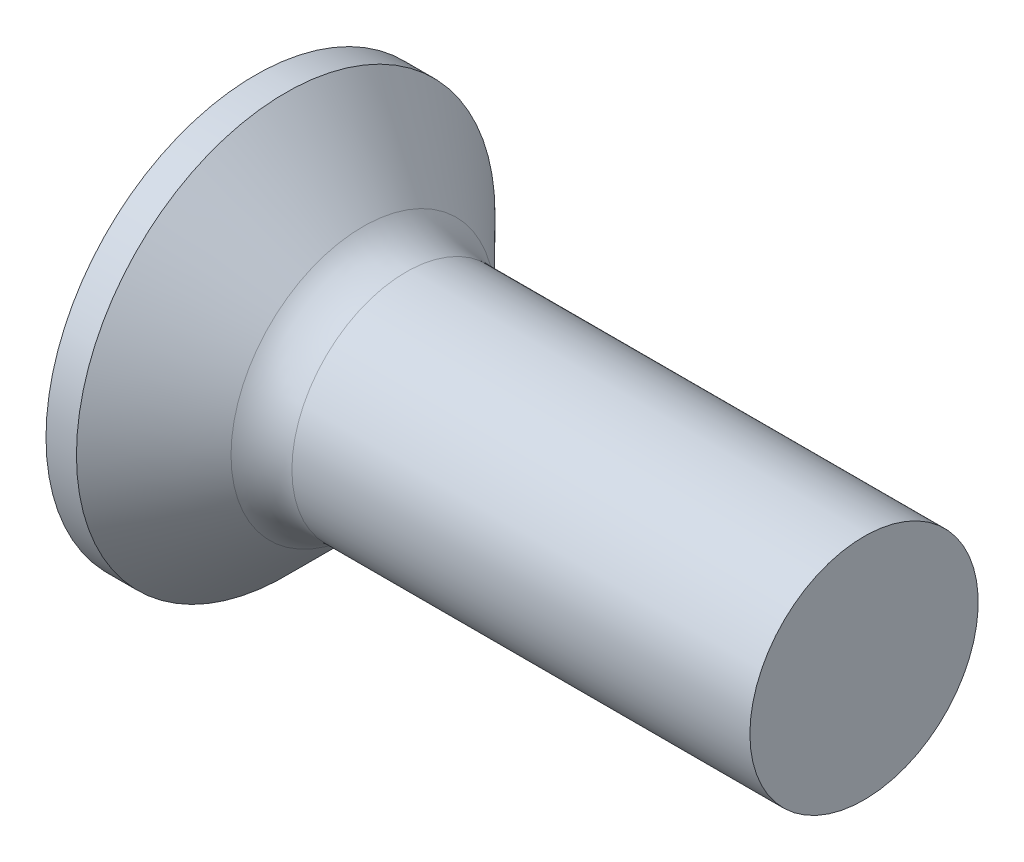
ISO-10303-21;
HEADER;
FILE_DESCRIPTION(('STEP AP214'),'2;1');
FILE_NAME('part.step','',(''),(''),'','','');
FILE_SCHEMA(('AUTOMOTIVE_DESIGN { 1 0 10303 214 1 1 1 1 }'));
ENDSEC;
DATA;
#1=APPLICATION_CONTEXT('core data for automotive mechanical design processes');
#2=APPLICATION_PROTOCOL_DEFINITION('international standard','automotive_design',2000,#1);
#3=PRODUCT_CONTEXT('',#1,'mechanical');
#4=PRODUCT('Part','Part','',(#3));
#5=PRODUCT_RELATED_PRODUCT_CATEGORY('part','',(#4));
#6=PRODUCT_DEFINITION_FORMATION('','',#4);
#7=PRODUCT_DEFINITION_CONTEXT('part definition',#1,'design');
#8=PRODUCT_DEFINITION('design','',#6,#7);
#9=PRODUCT_DEFINITION_SHAPE('','',#8);
#10=(LENGTH_UNIT() NAMED_UNIT(*) SI_UNIT(.MILLI.,.METRE.));
#11=(NAMED_UNIT(*) PLANE_ANGLE_UNIT() SI_UNIT($,.RADIAN.));
#12=(NAMED_UNIT(*) SI_UNIT($,.STERADIAN.) SOLID_ANGLE_UNIT());
#13=UNCERTAINTY_MEASURE_WITH_UNIT(LENGTH_MEASURE(1.E-05),#10,'distance_accuracy_value','');
#14=(GEOMETRIC_REPRESENTATION_CONTEXT(3) GLOBAL_UNCERTAINTY_ASSIGNED_CONTEXT((#13)) GLOBAL_UNIT_ASSIGNED_CONTEXT((#10,
#11,#12)) REPRESENTATION_CONTEXT('',''));
#15=CARTESIAN_POINT('',(0.,0.,0.));
#16=DIRECTION('',(0.,0.,1.));
#17=DIRECTION('',(1.,0.,0.));
#18=AXIS2_PLACEMENT_3D('',#15,#16,#17);
#19=CARTESIAN_POINT('',(2.01,-0.497851135403458,0.37));
#20=DIRECTION('',(0.,0.,-1.));
#21=DIRECTION('',(0.,1.,0.));
#22=AXIS2_PLACEMENT_3D('',#19,#20,#21);
#23=PLANE('',#22);
#24=DIRECTION('',(0.,-1.,0.));
#25=VECTOR('',#24,1.);
#26=CARTESIAN_POINT('',(0.,1.5,0.37));
#27=LINE('',#26,#25);
#28=CARTESIAN_POINT('',(0.,-0.590157547916263,0.37));
#29=VERTEX_POINT('',#28);
#30=CARTESIAN_POINT('',(0.,-1.5,0.37));
#31=VERTEX_POINT('',#30);
#32=EDGE_CURVE('E458',#29,#31,#27,.T.);
#33=ORIENTED_EDGE('',*,*,#32,.F.);
#34=CARTESIAN_POINT('',(-1.01053649691082,-0.672102030072118,0.37));
#35=CARTESIAN_POINT('',(-0.79970605871103,-0.655267098883947,0.37));
#36=CARTESIAN_POINT('',(-0.588886212503304,-0.638297110572311,0.37));
#37=CARTESIAN_POINT('',(-0.167272662529611,-0.603984130519828,0.37));
#38=CARTESIAN_POINT('',(0.0435210406290472,-0.586641131324258,0.37));
#39=CARTESIAN_POINT('',(0.465068838244709,-0.551479911667385,0.37));
#40=CARTESIAN_POINT('',(0.67582293271526,-0.533661691368909,0.37));
#41=CARTESIAN_POINT('',(1.09727362083221,-0.497387538872971,0.37));
#42=CARTESIAN_POINT('',(1.30797021521736,-0.478931615299089,0.37));
#43=CARTESIAN_POINT('',(1.67418894757201,-0.446067164121906,0.37));
#44=CARTESIAN_POINT('',(1.82972932585734,-0.431862501028414,0.37));
#45=CARTESIAN_POINT('',(2.14074770359484,-0.40279770973988,0.37));
#46=CARTESIAN_POINT('',(2.29622570356215,-0.38793758707517,0.37));
#47=CARTESIAN_POINT('',(2.60710169348415,-0.357305117937677,0.37));
#48=CARTESIAN_POINT('',(2.76249967840253,-0.34153271979064,0.37));
#49=CARTESIAN_POINT('',(2.99549070742189,-0.316847908281595,0.37));
#50=CARTESIAN_POINT('',(3.07313791118864,-0.308448465897182,0.37));
#51=CARTESIAN_POINT('',(3.22838341575769,-0.29120225104834,0.37));
#52=CARTESIAN_POINT('',(3.30598171599396,-0.282355473499083,0.37));
#53=CARTESIAN_POINT('',(3.38354828463398,-0.273232461289951,0.37));
#54=B_SPLINE_CURVE_WITH_KNOTS('',3,(#34,#35,#36,#37,#38,#39,#40,#41,#42,#43,#44,#45,#46,#47,#48,
#49,#50,#51,#52,#53),.UNSPECIFIED.,.F.,.F.,(4,2,2,2,2,2,2,2,2,4),(0.,0.634504777554397,
1.26902224766093,1.90353950036111,2.53804817592041,3.00661008438666,3.47516804019383,
3.94375256268972,4.17805198331268,4.41235406779909),.UNSPECIFIED.);
#55=CARTESIAN_POINT('',(2.01,-0.415013252800437,0.37));
#56=VERTEX_POINT('',#55);
#57=EDGE_CURVE('E213',#29,#56,#54,.T.);
#58=ORIENTED_EDGE('',*,*,#57,.T.);
#59=DIRECTION('',(0.,-1.,0.));
#60=VECTOR('',#59,1.);
#61=CARTESIAN_POINT('',(2.01,0.497851135403459,0.37));
#62=LINE('',#61,#60);
#63=CARTESIAN_POINT('',(2.01,-0.497851135403458,0.37));
#64=VERTEX_POINT('',#63);
#65=EDGE_CURVE('E366',#56,#64,#62,.T.);
#66=ORIENTED_EDGE('',*,*,#65,.T.);
#67=DIRECTION('',(0.894934391398442,0.446197753347436,0.));
#68=VECTOR('',#67,1.);
#69=CARTESIAN_POINT('',(0.,-1.5,0.37));
#70=LINE('',#69,#68);
#71=EDGE_CURVE('E466',#31,#64,#70,.T.);
#72=ORIENTED_EDGE('',*,*,#71,.F.);
#73=EDGE_LOOP('',(#33,#58,#66,#72));
#74=FACE_BOUND('',#73,.T.);
#75=ADVANCED_FACE('F34',(#74),#23,.T.);
#76=CARTESIAN_POINT('',(2.01,0.497851135403459,0.37));
#77=VERTEX_POINT('',#76);
#78=CARTESIAN_POINT('',(2.01,0.415013252800437,0.37));
#79=VERTEX_POINT('',#78);
#80=EDGE_CURVE('E362',#77,#79,#62,.T.);
#81=ORIENTED_EDGE('',*,*,#80,.T.);
#82=CARTESIAN_POINT('',(-1.01053649699026,0.672102030078459,0.37));
#83=CARTESIAN_POINT('',(-0.799706058781648,0.65526709888962,0.37));
#84=CARTESIAN_POINT('',(-0.588886212565099,0.638297110577309,0.37));
#85=CARTESIAN_POINT('',(-0.167272662573758,0.603984130523453,0.37));
#86=CARTESIAN_POINT('',(0.043521040593722,0.586641131327185,0.37));
#87=CARTESIAN_POINT('',(0.465068838236453,0.551479911668094,0.37));
#88=CARTESIAN_POINT('',(0.675822932725248,0.533661691368078,0.37));
#89=CARTESIAN_POINT('',(1.09727362087867,0.497387538868943,0.37));
#90=CARTESIAN_POINT('',(1.30797021528206,0.478931615293404,0.37));
#91=CARTESIAN_POINT('',(1.67418894765493,0.446067164114376,0.37));
#92=CARTESIAN_POINT('',(1.82972932594025,0.431862501020785,0.37));
#93=CARTESIAN_POINT('',(2.14074770367772,0.402797709732016,0.37));
#94=CARTESIAN_POINT('',(2.29622570364503,0.38793758706717,0.37));
#95=CARTESIAN_POINT('',(2.60710169356699,0.357305117929346,0.37));
#96=CARTESIAN_POINT('',(2.76249967848536,0.341532719782116,0.37));
#97=CARTESIAN_POINT('',(2.99549070750468,0.316847908272698,0.37));
#98=CARTESIAN_POINT('',(3.07313791127142,0.308448465888148,0.37));
#99=CARTESIAN_POINT('',(3.22838341584044,0.291202251038989,0.37));
#100=CARTESIAN_POINT('',(3.30598171607669,0.282355473489554,0.37));
#101=CARTESIAN_POINT('',(3.38354828471668,0.273232461280216,0.37));
#102=B_SPLINE_CURVE_WITH_KNOTS('',3,(#82,#83,#84,#85,#86,#87,#88,#89,#90,#91,#92,#93,#94,#95,
#96,#97,#98,#99,#100,#101),.UNSPECIFIED.,.F.,.F.,(4,2,2,2,2,2,2,2,2,4),(0.,0.634504777580945,
1.26902224771403,1.90353950046914,2.53804817608336,3.00661008454961,3.47516804035678,
3.94375256285268,4.17805198347564,4.41235406796206),.UNSPECIFIED.);
#103=CARTESIAN_POINT('',(0.,0.590157547916263,0.37));
#104=VERTEX_POINT('',#103);
#105=EDGE_CURVE('E206',#79,#104,#102,.F.);
#106=ORIENTED_EDGE('',*,*,#105,.T.);
#107=CARTESIAN_POINT('',(0.,1.5,0.37));
#108=VERTEX_POINT('',#107);
#109=EDGE_CURVE('E460',#108,#104,#27,.T.);
#110=ORIENTED_EDGE('',*,*,#109,.F.);
#111=DIRECTION('',(0.894934391398442,-0.446197753347436,0.));
#112=VECTOR('',#111,1.);
#113=CARTESIAN_POINT('',(0.,1.5,0.37));
#114=LINE('',#113,#112);
#115=EDGE_CURVE('E57',#108,#77,#114,.T.);
#116=ORIENTED_EDGE('',*,*,#115,.T.);
#117=EDGE_LOOP('',(#81,#106,#110,#116));
#118=FACE_BOUND('',#117,.T.);
#119=ADVANCED_FACE('F188',(#118),#23,.T.);
#120=CARTESIAN_POINT('',(2.01,0.497851135403458,-0.37));
#121=DIRECTION('',(0.,0.,1.));
#122=DIRECTION('',(1.,0.,0.));
#123=AXIS2_PLACEMENT_3D('',#120,#121,#122);
#124=PLANE('',#123);
#125=DIRECTION('',(0.,1.,0.));
#126=VECTOR('',#125,1.);
#127=CARTESIAN_POINT('',(2.01,-0.497851135403458,-0.37));
#128=LINE('',#127,#126);
#129=CARTESIAN_POINT('',(2.01,-0.497851135403458,-0.37));
#130=VERTEX_POINT('',#129);
#131=CARTESIAN_POINT('',(2.01,-0.415013252800437,-0.37));
#132=VERTEX_POINT('',#131);
#133=EDGE_CURVE('E375',#130,#132,#128,.T.);
#134=ORIENTED_EDGE('',*,*,#133,.T.);
#135=CARTESIAN_POINT('',(-1.01053649691082,-0.672102030072118,-0.37));
#136=CARTESIAN_POINT('',(-0.79970605871103,-0.655267098883947,-0.37));
#137=CARTESIAN_POINT('',(-0.588886212503305,-0.638297110572311,-0.37));
#138=CARTESIAN_POINT('',(-0.16727266252961,-0.603984130519828,-0.37));
#139=CARTESIAN_POINT('',(0.0435210406290472,-0.586641131324259,-0.37));
#140=CARTESIAN_POINT('',(0.465068838244709,-0.551479911667385,-0.37));
#141=CARTESIAN_POINT('',(0.67582293271526,-0.533661691368909,-0.37));
#142=CARTESIAN_POINT('',(1.09727362083221,-0.497387538872971,-0.37));
#143=CARTESIAN_POINT('',(1.30797021521736,-0.47893161529909,-0.37));
#144=CARTESIAN_POINT('',(1.67418894757201,-0.446067164121906,-0.37));
#145=CARTESIAN_POINT('',(1.82972932585734,-0.431862501028414,-0.37));
#146=CARTESIAN_POINT('',(2.14074770359484,-0.40279770973988,-0.37));
#147=CARTESIAN_POINT('',(2.29622570356215,-0.38793758707517,-0.37));
#148=CARTESIAN_POINT('',(2.60710169348415,-0.357305117937677,-0.37));
#149=CARTESIAN_POINT('',(2.76249967840254,-0.34153271979064,-0.37));
#150=CARTESIAN_POINT('',(2.99549070742189,-0.316847908281595,-0.37));
#151=CARTESIAN_POINT('',(3.07313791118864,-0.308448465897182,-0.37));
#152=CARTESIAN_POINT('',(3.22838341575769,-0.29120225104834,-0.37));
#153=CARTESIAN_POINT('',(3.30598171599396,-0.282355473499083,-0.37));
#154=CARTESIAN_POINT('',(3.38354828463398,-0.273232461289951,-0.37));
#155=B_SPLINE_CURVE_WITH_KNOTS('',3,(#135,#136,#137,#138,#139,#140,#141,#142,#143,#144,#145,
#146,#147,#148,#149,#150,#151,#152,#153,#154),.UNSPECIFIED.,.F.,.F.,(4,2,2,2,2,2,2,2,2,4),(0.,
0.634504777554397,1.26902224766093,1.90353950036111,2.53804817592041,3.00661008438666,
3.47516804019383,3.94375256268973,4.17805198331268,4.41235406779909),.UNSPECIFIED.);
#156=CARTESIAN_POINT('',(0.,-0.590157547916263,-0.37));
#157=VERTEX_POINT('',#156);
#158=EDGE_CURVE('E269',#132,#157,#155,.F.);
#159=ORIENTED_EDGE('',*,*,#158,.T.);
#160=DIRECTION('',(0.,1.,0.));
#161=VECTOR('',#160,1.);
#162=CARTESIAN_POINT('',(0.,-1.5,-0.37));
#163=LINE('',#162,#161);
#164=CARTESIAN_POINT('',(0.,-1.5,-0.37));
#165=VERTEX_POINT('',#164);
#166=EDGE_CURVE('E459',#165,#157,#163,.T.);
#167=ORIENTED_EDGE('',*,*,#166,.F.);
#168=DIRECTION('',(0.894934391398442,0.446197753347436,0.));
#169=VECTOR('',#168,1.);
#170=CARTESIAN_POINT('',(0.,-1.5,-0.37));
#171=LINE('',#170,#169);
#172=EDGE_CURVE('E469',#165,#130,#171,.T.);
#173=ORIENTED_EDGE('',*,*,#172,.T.);
#174=EDGE_LOOP('',(#134,#159,#167,#173));
#175=FACE_BOUND('',#174,.T.);
#176=ADVANCED_FACE('F194',(#175),#124,.T.);
#177=CARTESIAN_POINT('',(0.,0.590157547916263,-0.37));
#178=VERTEX_POINT('',#177);
#179=CARTESIAN_POINT('',(0.,1.5,-0.37));
#180=VERTEX_POINT('',#179);
#181=EDGE_CURVE('E465',#178,#180,#163,.T.);
#182=ORIENTED_EDGE('',*,*,#181,.F.);
#183=CARTESIAN_POINT('',(-1.01053649691082,0.672102030072118,-0.37));
#184=CARTESIAN_POINT('',(-0.79970605871103,0.655267098883947,-0.37));
#185=CARTESIAN_POINT('',(-0.588886212503304,0.638297110572311,-0.37));
#186=CARTESIAN_POINT('',(-0.16727266252961,0.603984130519828,-0.37));
#187=CARTESIAN_POINT('',(0.0435210406290473,0.586641131324259,-0.37));
#188=CARTESIAN_POINT('',(0.465068838244709,0.551479911667385,-0.37));
#189=CARTESIAN_POINT('',(0.67582293271526,0.533661691368909,-0.37));
#190=CARTESIAN_POINT('',(1.09727362083221,0.497387538872971,-0.37));
#191=CARTESIAN_POINT('',(1.30797021521736,0.478931615299089,-0.37));
#192=CARTESIAN_POINT('',(1.67418894757201,0.446067164121906,-0.37));
#193=CARTESIAN_POINT('',(1.82972932585734,0.431862501028415,-0.37));
#194=CARTESIAN_POINT('',(2.14074770359484,0.40279770973988,-0.37));
#195=CARTESIAN_POINT('',(2.29622570356215,0.38793758707517,-0.37));
#196=CARTESIAN_POINT('',(2.60710169348415,0.357305117937677,-0.37));
#197=CARTESIAN_POINT('',(2.76249967840253,0.34153271979064,-0.37));
#198=CARTESIAN_POINT('',(2.99549070742189,0.316847908281595,-0.37));
#199=CARTESIAN_POINT('',(3.07313791118864,0.308448465897183,-0.37));
#200=CARTESIAN_POINT('',(3.22838341575769,0.29120225104834,-0.37));
#201=CARTESIAN_POINT('',(3.30598171599396,0.282355473499083,-0.37));
#202=CARTESIAN_POINT('',(3.38354828463398,0.273232461289951,-0.37));
#203=B_SPLINE_CURVE_WITH_KNOTS('',3,(#183,#184,#185,#186,#187,#188,#189,#190,#191,#192,#193,
#194,#195,#196,#197,#198,#199,#200,#201,#202),.UNSPECIFIED.,.F.,.F.,(4,2,2,2,2,2,2,2,2,4),(0.,
0.634504777554397,1.26902224766093,1.90353950036111,2.53804817592041,3.00661008438666,
3.47516804019383,3.94375256268972,4.17805198331267,4.41235406779909),.UNSPECIFIED.);
#204=CARTESIAN_POINT('',(2.01,0.415013252800437,-0.37));
#205=VERTEX_POINT('',#204);
#206=EDGE_CURVE('E263',#178,#205,#203,.T.);
#207=ORIENTED_EDGE('',*,*,#206,.T.);
#208=CARTESIAN_POINT('',(2.01,0.497851135403459,-0.37));
#209=VERTEX_POINT('',#208);
#210=EDGE_CURVE('E377',#205,#209,#128,.T.);
#211=ORIENTED_EDGE('',*,*,#210,.T.);
#212=DIRECTION('',(0.894934391398442,-0.446197753347436,0.));
#213=VECTOR('',#212,1.);
#214=CARTESIAN_POINT('',(0.,1.5,-0.37));
#215=LINE('',#214,#213);
#216=EDGE_CURVE('E374',#180,#209,#215,.T.);
#217=ORIENTED_EDGE('',*,*,#216,.F.);
#218=EDGE_LOOP('',(#182,#207,#211,#217));
#219=FACE_BOUND('',#218,.T.);
#220=ADVANCED_FACE('F476',(#219),#124,.T.);
#221=CARTESIAN_POINT('',(2.01,0.497851135403459,-0.37));
#222=DIRECTION('',(1.,0.,0.));
#223=DIRECTION('',(0.,0.,-1.));
#224=AXIS2_PLACEMENT_3D('',#221,#222,#223);
#225=PLANE('',#224);
#226=CARTESIAN_POINT('',(2.01,0.,0.));
#227=DIRECTION('',(-1.,0.,0.));
#228=DIRECTION('',(0.,0.,1.));
#229=AXIS2_PLACEMENT_3D('',#226,#227,#228);
#230=CIRCLE('',#229,0.555999999999999);
#231=CARTESIAN_POINT('',(2.01,-0.24754847399547,-0.497851135403459));
#232=VERTEX_POINT('',#231);
#233=CARTESIAN_POINT('',(2.01,-0.369999999999999,-0.415013252800438));
#234=VERTEX_POINT('',#233);
#235=EDGE_CURVE('E341',#232,#234,#230,.T.);
#236=ORIENTED_EDGE('',*,*,#235,.F.);
#237=DIRECTION('',(0.,1.,0.));
#238=VECTOR('',#237,1.);
#239=CARTESIAN_POINT('',(2.01,-0.369999999999998,-0.49785113540346));
#240=LINE('',#239,#238);
#241=CARTESIAN_POINT('',(2.01,-0.369999999999998,-0.49785113540346));
#242=VERTEX_POINT('',#241);
#243=EDGE_CURVE('E443',#242,#232,#240,.T.);
#244=ORIENTED_EDGE('',*,*,#243,.F.);
#245=DIRECTION('',(0.,0.,-1.));
#246=VECTOR('',#245,1.);
#247=CARTESIAN_POINT('',(2.01,-0.370000000000002,0.497851135403457));
#248=LINE('',#247,#246);
#249=EDGE_CURVE('E447',#234,#242,#248,.T.);
#250=ORIENTED_EDGE('',*,*,#249,.F.);
#251=EDGE_LOOP('',(#236,#244,#250));
#252=FACE_BOUND('',#251,.T.);
#253=ADVANCED_FACE('F488',(#252),#225,.F.);
#254=CARTESIAN_POINT('',(2.01,-0.497851135403458,-0.247548473995472));
#255=VERTEX_POINT('',#254);
#256=EDGE_CURVE('E336',#132,#255,#230,.T.);
#257=ORIENTED_EDGE('',*,*,#256,.F.);
#258=ORIENTED_EDGE('',*,*,#133,.F.);
#259=DIRECTION('',(0.,0.,-1.));
#260=VECTOR('',#259,1.);
#261=CARTESIAN_POINT('',(2.01,-0.497851135403458,0.37));
#262=LINE('',#261,#260);
#263=EDGE_CURVE('E365',#255,#130,#262,.T.);
#264=ORIENTED_EDGE('',*,*,#263,.F.);
#265=EDGE_LOOP('',(#257,#258,#264));
#266=FACE_BOUND('',#265,.T.);
#267=ADVANCED_FACE('F494',(#266),#225,.F.);
#268=CARTESIAN_POINT('',(2.01,-0.497851135403458,0.247548473995472));
#269=VERTEX_POINT('',#268);
#270=EDGE_CURVE('E331',#269,#56,#230,.T.);
#271=ORIENTED_EDGE('',*,*,#270,.F.);
#272=EDGE_CURVE('E368',#64,#269,#262,.T.);
#273=ORIENTED_EDGE('',*,*,#272,.F.);
#274=ORIENTED_EDGE('',*,*,#65,.F.);
#275=EDGE_LOOP('',(#271,#273,#274));
#276=FACE_BOUND('',#275,.T.);
#277=ADVANCED_FACE('F500',(#276),#225,.F.);
#278=CARTESIAN_POINT('',(2.01,-0.370000000000001,0.415013252800436));
#279=VERTEX_POINT('',#278);
#280=CARTESIAN_POINT('',(2.01,-0.247548473995473,0.497851135403458));
#281=VERTEX_POINT('',#280);
#282=EDGE_CURVE('E49',#279,#281,#230,.T.);
#283=ORIENTED_EDGE('',*,*,#282,.F.);
#284=CARTESIAN_POINT('',(2.01,-0.370000000000002,0.497851135403457));
#285=VERTEX_POINT('',#284);
#286=EDGE_CURVE('E449',#285,#279,#248,.T.);
#287=ORIENTED_EDGE('',*,*,#286,.F.);
#288=DIRECTION('',(0.,-1.,0.));
#289=VECTOR('',#288,1.);
#290=CARTESIAN_POINT('',(2.01,0.369999999999998,0.49785113540346));
#291=LINE('',#290,#289);
#292=EDGE_CURVE('E448',#281,#285,#291,.T.);
#293=ORIENTED_EDGE('',*,*,#292,.F.);
#294=EDGE_LOOP('',(#283,#287,#293));
#295=FACE_BOUND('',#294,.T.);
#296=ADVANCED_FACE('F527',(#295),#225,.F.);
#297=CARTESIAN_POINT('',(2.01,0.24754847399547,0.497851135403459));
#298=VERTEX_POINT('',#297);
#299=CARTESIAN_POINT('',(2.01,0.369999999999999,0.415013252800438));
#300=VERTEX_POINT('',#299);
#301=EDGE_CURVE('E322',#298,#300,#230,.T.);
#302=ORIENTED_EDGE('',*,*,#301,.F.);
#303=CARTESIAN_POINT('',(2.01,0.369999999999998,0.49785113540346));
#304=VERTEX_POINT('',#303);
#305=EDGE_CURVE('E444',#304,#298,#291,.T.);
#306=ORIENTED_EDGE('',*,*,#305,.F.);
#307=DIRECTION('',(0.,0.,1.));
#308=VECTOR('',#307,1.);
#309=CARTESIAN_POINT('',(2.01,0.370000000000002,-0.497851135403457));
#310=LINE('',#309,#308);
#311=EDGE_CURVE('E220',#300,#304,#310,.T.);
#312=ORIENTED_EDGE('',*,*,#311,.F.);
#313=EDGE_LOOP('',(#302,#306,#312));
#314=FACE_BOUND('',#313,.T.);
#315=ADVANCED_FACE('F485',(#314),#225,.F.);
#316=CARTESIAN_POINT('',(2.01,0.497851135403459,0.247548473995472));
#317=VERTEX_POINT('',#316);
#318=EDGE_CURVE('E329',#79,#317,#230,.T.);
#319=ORIENTED_EDGE('',*,*,#318,.F.);
#320=ORIENTED_EDGE('',*,*,#80,.F.);
#321=DIRECTION('',(0.,0.,1.));
#322=VECTOR('',#321,1.);
#323=CARTESIAN_POINT('',(2.01,0.497851135403459,-0.37));
#324=LINE('',#323,#322);
#325=EDGE_CURVE('E363',#317,#77,#324,.T.);
#326=ORIENTED_EDGE('',*,*,#325,.F.);
#327=EDGE_LOOP('',(#319,#320,#326));
#328=FACE_BOUND('',#327,.T.);
#329=ADVANCED_FACE('F361',(#328),#225,.F.);
#330=CARTESIAN_POINT('',(2.01,0.497851135403459,-0.247548473995472));
#331=VERTEX_POINT('',#330);
#332=EDGE_CURVE('E351',#331,#205,#230,.T.);
#333=ORIENTED_EDGE('',*,*,#332,.F.);
#334=EDGE_CURVE('E370',#209,#331,#324,.T.);
#335=ORIENTED_EDGE('',*,*,#334,.F.);
#336=ORIENTED_EDGE('',*,*,#210,.F.);
#337=EDGE_LOOP('',(#333,#335,#336));
#338=FACE_BOUND('',#337,.T.);
#339=ADVANCED_FACE('F478',(#338),#225,.F.);
#340=CARTESIAN_POINT('',(2.01,-0.497851135403458,-0.37));
#341=DIRECTION('',(-0.446197753347436,0.894934391398443,0.));
#342=DIRECTION('',(-0.894934391398442,-0.446197753347436,0.));
#343=AXIS2_PLACEMENT_3D('',#340,#341,#342);
#344=PLANE('',#343);
#345=ORIENTED_EDGE('',*,*,#272,.T.);
#346=CARTESIAN_POINT('',(2.86902919914418,-0.0695550475538963,0.));
#347=DIRECTION('',(-0.446197753347436,0.894934391398443,0.));
#348=DIRECTION('',(-0.894934391398443,-0.446197753347436,0.));
#349=AXIS2_PLACEMENT_3D('',#346,#347,#348);
#350=ELLIPSE('',#349,1.11145971268776,0.491029001453358);
#351=EDGE_CURVE('E281',#269,#255,#350,.F.);
#352=ORIENTED_EDGE('',*,*,#351,.T.);
#353=ORIENTED_EDGE('',*,*,#263,.T.);
#354=ORIENTED_EDGE('',*,*,#172,.F.);
#355=DIRECTION('',(0.,0.,-1.));
#356=VECTOR('',#355,1.);
#357=CARTESIAN_POINT('',(0.,-1.5,0.37));
#358=LINE('',#357,#356);
#359=EDGE_CURVE('E382',#31,#165,#358,.T.);
#360=ORIENTED_EDGE('',*,*,#359,.F.);
#361=ORIENTED_EDGE('',*,*,#71,.T.);
#362=EDGE_LOOP('',(#345,#352,#353,#354,#360,#361));
#363=FACE_BOUND('',#362,.T.);
#364=ADVANCED_FACE('F200',(#363),#344,.T.);
#365=CARTESIAN_POINT('',(2.01,0.497851135403459,0.37));
#366=DIRECTION('',(-0.446197753347436,-0.894934391398443,0.));
#367=DIRECTION('',(0.894934391398442,-0.446197753347436,0.));
#368=AXIS2_PLACEMENT_3D('',#365,#366,#367);
#369=PLANE('',#368);
#370=ORIENTED_EDGE('',*,*,#334,.T.);
#371=CARTESIAN_POINT('',(2.86902919914418,0.0695550475538964,0.));
#372=DIRECTION('',(-0.446197753347436,-0.894934391398443,0.));
#373=DIRECTION('',(-0.894934391398443,0.446197753347436,0.));
#374=AXIS2_PLACEMENT_3D('',#371,#372,#373);
#375=ELLIPSE('',#374,1.11145971268776,0.491029001453358);
#376=EDGE_CURVE('E286',#331,#317,#375,.F.);
#377=ORIENTED_EDGE('',*,*,#376,.T.);
#378=ORIENTED_EDGE('',*,*,#325,.T.);
#379=ORIENTED_EDGE('',*,*,#115,.F.);
#380=DIRECTION('',(0.,0.,1.));
#381=VECTOR('',#380,1.);
#382=CARTESIAN_POINT('',(0.,1.5,-0.37));
#383=LINE('',#382,#381);
#384=EDGE_CURVE('E455',#180,#108,#383,.T.);
#385=ORIENTED_EDGE('',*,*,#384,.F.);
#386=ORIENTED_EDGE('',*,*,#216,.T.);
#387=EDGE_LOOP('',(#370,#377,#378,#379,#385,#386));
#388=FACE_BOUND('',#387,.T.);
#389=ADVANCED_FACE('F474',(#388),#369,.T.);
#390=CARTESIAN_POINT('',(2.01,0.369999999999998,0.497851135403459));
#391=DIRECTION('',(0.,-1.,0.));
#392=DIRECTION('',(1.,0.,0.));
#393=AXIS2_PLACEMENT_3D('',#390,#391,#392);
#394=PLANE('',#393);
#395=CARTESIAN_POINT('',(2.01,0.370000000000002,-0.497851135403457));
#396=VERTEX_POINT('',#395);
#397=CARTESIAN_POINT('',(2.01,0.370000000000001,-0.415013252800436));
#398=VERTEX_POINT('',#397);
#399=EDGE_CURVE('E453',#396,#398,#310,.T.);
#400=ORIENTED_EDGE('',*,*,#399,.T.);
#401=CARTESIAN_POINT('',(-1.01053649699026,0.370000000000002,-0.672102030078458));
#402=CARTESIAN_POINT('',(-0.799706058781648,0.370000000000002,-0.655267098889619));
#403=CARTESIAN_POINT('',(-0.588886212565099,0.370000000000002,-0.638297110577308));
#404=CARTESIAN_POINT('',(-0.167272662573758,0.370000000000002,-0.603984130523452));
#405=CARTESIAN_POINT('',(0.0435210405937218,0.370000000000002,-0.586641131327184));
#406=CARTESIAN_POINT('',(0.465068838236452,0.370000000000002,-0.551479911668093));
#407=CARTESIAN_POINT('',(0.675822932725247,0.370000000000002,-0.533661691368077));
#408=CARTESIAN_POINT('',(1.09727362087867,0.370000000000002,-0.497387538868942));
#409=CARTESIAN_POINT('',(1.30797021528206,0.370000000000002,-0.478931615293403));
#410=CARTESIAN_POINT('',(1.67418894765493,0.370000000000001,-0.446067164114375));
#411=CARTESIAN_POINT('',(1.82972932594025,0.370000000000001,-0.431862501020784));
#412=CARTESIAN_POINT('',(2.14074770367772,0.370000000000001,-0.402797709732014));
#413=CARTESIAN_POINT('',(2.29622570364503,0.370000000000001,-0.387937587067169));
#414=CARTESIAN_POINT('',(2.60710169356699,0.370000000000001,-0.357305117929345));
#415=CARTESIAN_POINT('',(2.76249967848536,0.370000000000001,-0.341532719782114));
#416=CARTESIAN_POINT('',(2.99549070750468,0.370000000000001,-0.316847908272697));
#417=CARTESIAN_POINT('',(3.07313791127142,0.370000000000001,-0.308448465888147));
#418=CARTESIAN_POINT('',(3.22838341584044,0.370000000000001,-0.291202251038988));
#419=CARTESIAN_POINT('',(3.30598171607669,0.370000000000001,-0.282355473489552));
#420=CARTESIAN_POINT('',(3.38354828471668,0.370000000000001,-0.273232461280215));
#421=B_SPLINE_CURVE_WITH_KNOTS('',3,(#401,#402,#403,#404,#405,#406,#407,#408,#409,#410,#411,
#412,#413,#414,#415,#416,#417,#418,#419,#420),.UNSPECIFIED.,.F.,.F.,(4,2,2,2,2,2,2,2,2,4),(0.,
0.634504777580945,1.26902224771403,1.90353950046914,2.53804817608336,3.00661008454961,
3.47516804035678,3.94375256285268,4.17805198347564,4.41235406796206),.UNSPECIFIED.);
#422=CARTESIAN_POINT('',(0.,0.370000000000002,-0.590157547916262));
#423=VERTEX_POINT('',#422);
#424=EDGE_CURVE('E255',#398,#423,#421,.F.);
#425=ORIENTED_EDGE('',*,*,#424,.T.);
#426=DIRECTION('',(0.,0.,1.));
#427=VECTOR('',#426,1.);
#428=CARTESIAN_POINT('',(0.,0.370000000000005,-1.5));
#429=LINE('',#428,#427);
#430=CARTESIAN_POINT('',(0.,0.370000000000005,-1.5));
#431=VERTEX_POINT('',#430);
#432=EDGE_CURVE('E429',#431,#423,#429,.T.);
#433=ORIENTED_EDGE('',*,*,#432,.F.);
#434=DIRECTION('',(0.894934391398442,0.,0.446197753347436));
#435=VECTOR('',#434,1.);
#436=CARTESIAN_POINT('',(0.,0.370000000000005,-1.5));
#437=LINE('',#436,#435);
#438=EDGE_CURVE('E435',#431,#396,#437,.T.);
#439=ORIENTED_EDGE('',*,*,#438,.T.);
#440=EDGE_LOOP('',(#400,#425,#433,#439));
#441=FACE_BOUND('',#440,.T.);
#442=ADVANCED_FACE('F607',(#441),#394,.T.);
#443=CARTESIAN_POINT('',(2.01,-0.369999999999998,-0.497851135403459));
#444=DIRECTION('',(0.,1.,0.));
#445=DIRECTION('',(0.,0.,1.));
#446=AXIS2_PLACEMENT_3D('',#443,#444,#445);
#447=PLANE('',#446);
#448=DIRECTION('',(0.,0.,-1.));
#449=VECTOR('',#448,1.);
#450=CARTESIAN_POINT('',(0.,-0.370000000000005,1.5));
#451=LINE('',#450,#449);
#452=CARTESIAN_POINT('',(0.,-0.369999999999998,-0.590157547916264));
#453=VERTEX_POINT('',#452);
#454=CARTESIAN_POINT('',(0.,-0.369999999999995,-1.5));
#455=VERTEX_POINT('',#454);
#456=EDGE_CURVE('E425',#453,#455,#451,.T.);
#457=ORIENTED_EDGE('',*,*,#456,.F.);
#458=CARTESIAN_POINT('',(-1.01053649699026,-0.369999999999998,-0.67210203007846));
#459=CARTESIAN_POINT('',(-0.799706058781648,-0.369999999999998,-0.655267098889622));
#460=CARTESIAN_POINT('',(-0.588886212565099,-0.369999999999998,-0.638297110577311));
#461=CARTESIAN_POINT('',(-0.167272662573759,-0.369999999999998,-0.603984130523454));
#462=CARTESIAN_POINT('',(0.0435210405937218,-0.369999999999998,-0.586641131327186));
#463=CARTESIAN_POINT('',(0.465068838236453,-0.369999999999998,-0.551479911668095));
#464=CARTESIAN_POINT('',(0.675822932725248,-0.369999999999998,-0.53366169136808));
#465=CARTESIAN_POINT('',(1.09727362087867,-0.369999999999998,-0.497387538868944));
#466=CARTESIAN_POINT('',(1.30797021528206,-0.369999999999998,-0.478931615293405));
#467=CARTESIAN_POINT('',(1.67418894765493,-0.369999999999999,-0.446067164114377));
#468=CARTESIAN_POINT('',(1.82972932594025,-0.369999999999999,-0.431862501020786));
#469=CARTESIAN_POINT('',(2.14074770367772,-0.369999999999999,-0.402797709732017));
#470=CARTESIAN_POINT('',(2.29622570364503,-0.369999999999999,-0.387937587067171));
#471=CARTESIAN_POINT('',(2.60710169356699,-0.369999999999999,-0.357305117929348));
#472=CARTESIAN_POINT('',(2.76249967848536,-0.369999999999999,-0.341532719782117));
#473=CARTESIAN_POINT('',(2.99549070750468,-0.369999999999999,-0.316847908272699));
#474=CARTESIAN_POINT('',(3.07313791127142,-0.369999999999999,-0.30844846588815));
#475=CARTESIAN_POINT('',(3.22838341584044,-0.369999999999999,-0.291202251038991));
#476=CARTESIAN_POINT('',(3.30598171607669,-0.369999999999999,-0.282355473489555));
#477=CARTESIAN_POINT('',(3.38354828471668,-0.369999999999999,-0.273232461280217));
#478=B_SPLINE_CURVE_WITH_KNOTS('',3,(#458,#459,#460,#461,#462,#463,#464,#465,#466,#467,#468,
#469,#470,#471,#472,#473,#474,#475,#476,#477),.UNSPECIFIED.,.F.,.F.,(4,2,2,2,2,2,2,2,2,4),(0.,
0.634504777580943,1.26902224771403,1.90353950046914,2.53804817608336,3.00661008454961,
3.47516804035678,3.94375256285268,4.17805198347564,4.41235406796206),.UNSPECIFIED.);
#479=EDGE_CURVE('E248',#453,#234,#478,.T.);
#480=ORIENTED_EDGE('',*,*,#479,.T.);
#481=ORIENTED_EDGE('',*,*,#249,.T.);
#482=DIRECTION('',(0.894934391398442,0.,0.446197753347436));
#483=VECTOR('',#482,1.);
#484=CARTESIAN_POINT('',(0.,-0.369999999999995,-1.5));
#485=LINE('',#484,#483);
#486=EDGE_CURVE('E432',#455,#242,#485,.T.);
#487=ORIENTED_EDGE('',*,*,#486,.F.);
#488=EDGE_LOOP('',(#457,#480,#481,#487));
#489=FACE_BOUND('',#488,.T.);
#490=ADVANCED_FACE('F505',(#489),#447,.T.);
#491=CARTESIAN_POINT('',(2.01,0.370000000000002,-0.497851135403457));
#492=DIRECTION('',(-0.446197753347436,0.,0.894934391398443));
#493=DIRECTION('',(-0.894934391398442,0.,-0.446197753347436));
#494=AXIS2_PLACEMENT_3D('',#491,#492,#493);
#495=PLANE('',#494);
#496=ORIENTED_EDGE('',*,*,#243,.T.);
#497=CARTESIAN_POINT('',(2.86902919914418,0.,-0.0695550475538964));
#498=DIRECTION('',(-0.446197753347436,0.,0.894934391398443));
#499=DIRECTION('',(-0.894934391398443,0.,-0.446197753347436));
#500=AXIS2_PLACEMENT_3D('',#497,#498,#499);
#501=ELLIPSE('',#500,1.11145971268776,0.491029001453358);
#502=CARTESIAN_POINT('',(2.01,0.247548473995474,-0.497851135403457));
#503=VERTEX_POINT('',#502);
#504=EDGE_CURVE('E299',#232,#503,#501,.F.);
#505=ORIENTED_EDGE('',*,*,#504,.T.);
#506=EDGE_CURVE('E451',#503,#396,#240,.T.);
#507=ORIENTED_EDGE('',*,*,#506,.T.);
#508=ORIENTED_EDGE('',*,*,#438,.F.);
#509=DIRECTION('',(0.,1.,0.));
#510=VECTOR('',#509,1.);
#511=CARTESIAN_POINT('',(0.,-0.369999999999995,-1.5));
#512=LINE('',#511,#510);
#513=EDGE_CURVE('E424',#455,#431,#512,.T.);
#514=ORIENTED_EDGE('',*,*,#513,.F.);
#515=ORIENTED_EDGE('',*,*,#486,.T.);
#516=EDGE_LOOP('',(#496,#505,#507,#508,#514,#515));
#517=FACE_BOUND('',#516,.T.);
#518=ADVANCED_FACE('F225',(#517),#495,.T.);
#519=ORIENTED_EDGE('',*,*,#286,.T.);
#520=CARTESIAN_POINT('',(-1.01053649699026,-0.370000000000002,0.672102030078458));
#521=CARTESIAN_POINT('',(-0.799706058781648,-0.370000000000002,0.655267098889619));
#522=CARTESIAN_POINT('',(-0.588886212565099,-0.370000000000002,0.638297110577308));
#523=CARTESIAN_POINT('',(-0.167272662573758,-0.370000000000002,0.603984130523451));
#524=CARTESIAN_POINT('',(0.0435210405937218,-0.370000000000002,0.586641131327183));
#525=CARTESIAN_POINT('',(0.465068838236452,-0.370000000000002,0.551479911668093));
#526=CARTESIAN_POINT('',(0.675822932725247,-0.370000000000002,0.533661691368077));
#527=CARTESIAN_POINT('',(1.09727362087867,-0.370000000000002,0.497387538868942));
#528=CARTESIAN_POINT('',(1.30797021528206,-0.370000000000002,0.478931615293403));
#529=CARTESIAN_POINT('',(1.67418894765493,-0.370000000000002,0.446067164114375));
#530=CARTESIAN_POINT('',(1.82972932594025,-0.370000000000001,0.431862501020784));
#531=CARTESIAN_POINT('',(2.14074770367772,-0.370000000000001,0.402797709732014));
#532=CARTESIAN_POINT('',(2.29622570364503,-0.370000000000001,0.387937587067169));
#533=CARTESIAN_POINT('',(2.60710169356699,-0.370000000000001,0.357305117929345));
#534=CARTESIAN_POINT('',(2.76249967848536,-0.370000000000001,0.341532719782114));
#535=CARTESIAN_POINT('',(2.99549070750468,-0.370000000000001,0.316847908272697));
#536=CARTESIAN_POINT('',(3.07313791127142,-0.370000000000001,0.308448465888147));
#537=CARTESIAN_POINT('',(3.22838341584044,-0.370000000000001,0.291202251038988));
#538=CARTESIAN_POINT('',(3.30598171607669,-0.370000000000001,0.282355473489552));
#539=CARTESIAN_POINT('',(3.38354828471668,-0.370000000000001,0.273232461280214));
#540=B_SPLINE_CURVE_WITH_KNOTS('',3,(#520,#521,#522,#523,#524,#525,#526,#527,#528,#529,#530,
#531,#532,#533,#534,#535,#536,#537,#538,#539),.UNSPECIFIED.,.F.,.F.,(4,2,2,2,2,2,2,2,2,4),(0.,
0.634504777580945,1.26902224771403,1.90353950046914,2.53804817608336,3.00661008454961,
3.47516804035678,3.94375256285268,4.17805198347564,4.41235406796206),.UNSPECIFIED.);
#541=CARTESIAN_POINT('',(0.,-0.370000000000002,0.590157547916262));
#542=VERTEX_POINT('',#541);
#543=EDGE_CURVE('E240',#279,#542,#540,.F.);
#544=ORIENTED_EDGE('',*,*,#543,.T.);
#545=CARTESIAN_POINT('',(0.,-0.370000000000005,1.5));
#546=VERTEX_POINT('',#545);
#547=EDGE_CURVE('E420',#546,#542,#451,.T.);
#548=ORIENTED_EDGE('',*,*,#547,.F.);
#549=DIRECTION('',(0.894934391398442,0.,-0.446197753347436));
#550=VECTOR('',#549,1.);
#551=CARTESIAN_POINT('',(0.,-0.370000000000005,1.5));
#552=LINE('',#551,#550);
#553=EDGE_CURVE('E438',#546,#285,#552,.T.);
#554=ORIENTED_EDGE('',*,*,#553,.T.);
#555=EDGE_LOOP('',(#519,#544,#548,#554));
#556=FACE_BOUND('',#555,.T.);
#557=ADVANCED_FACE('F525',(#556),#447,.T.);
#558=CARTESIAN_POINT('',(0.,0.369999999999998,0.590157547916264));
#559=VERTEX_POINT('',#558);
#560=CARTESIAN_POINT('',(0.,0.369999999999995,1.5));
#561=VERTEX_POINT('',#560);
#562=EDGE_CURVE('E431',#559,#561,#429,.T.);
#563=ORIENTED_EDGE('',*,*,#562,.F.);
#564=CARTESIAN_POINT('',(-1.01053649699026,0.369999999999997,0.67210203007846));
#565=CARTESIAN_POINT('',(-0.799706058781648,0.369999999999998,0.655267098889622));
#566=CARTESIAN_POINT('',(-0.588886212565098,0.369999999999998,0.638297110577311));
#567=CARTESIAN_POINT('',(-0.167272662573758,0.369999999999998,0.603984130523454));
#568=CARTESIAN_POINT('',(0.0435210405937221,0.369999999999998,0.586641131327186));
#569=CARTESIAN_POINT('',(0.465068838236453,0.369999999999998,0.551479911668096));
#570=CARTESIAN_POINT('',(0.675822932725248,0.369999999999998,0.53366169136808));
#571=CARTESIAN_POINT('',(1.09727362087867,0.369999999999998,0.497387538868944));
#572=CARTESIAN_POINT('',(1.30797021528206,0.369999999999998,0.478931615293405));
#573=CARTESIAN_POINT('',(1.67418894765493,0.369999999999998,0.446067164114377));
#574=CARTESIAN_POINT('',(1.82972932594025,0.369999999999998,0.431862501020787));
#575=CARTESIAN_POINT('',(2.14074770367772,0.369999999999999,0.402797709732017));
#576=CARTESIAN_POINT('',(2.29622570364503,0.369999999999999,0.387937587067172));
#577=CARTESIAN_POINT('',(2.60710169356699,0.369999999999999,0.357305117929348));
#578=CARTESIAN_POINT('',(2.76249967848536,0.369999999999999,0.341532719782117));
#579=CARTESIAN_POINT('',(2.99549070750468,0.369999999999999,0.3168479082727));
#580=CARTESIAN_POINT('',(3.07313791127142,0.369999999999999,0.30844846588815));
#581=CARTESIAN_POINT('',(3.22838341584044,0.369999999999999,0.291202251038991));
#582=CARTESIAN_POINT('',(3.30598171607669,0.369999999999999,0.282355473489555));
#583=CARTESIAN_POINT('',(3.38354828471668,0.369999999999999,0.273232461280217));
#584=B_SPLINE_CURVE_WITH_KNOTS('',3,(#564,#565,#566,#567,#568,#569,#570,#571,#572,#573,#574,
#575,#576,#577,#578,#579,#580,#581,#582,#583),.UNSPECIFIED.,.F.,.F.,(4,2,2,2,2,2,2,2,2,4),(0.,
0.634504777580945,1.26902224771403,1.90353950046914,2.53804817608336,3.00661008454961,
3.47516804035678,3.94375256285268,4.17805198347564,4.41235406796206),.UNSPECIFIED.);
#585=EDGE_CURVE('E230',#559,#300,#584,.T.);
#586=ORIENTED_EDGE('',*,*,#585,.T.);
#587=ORIENTED_EDGE('',*,*,#311,.T.);
#588=DIRECTION('',(0.894934391398442,0.,-0.446197753347436));
#589=VECTOR('',#588,1.);
#590=CARTESIAN_POINT('',(0.,0.369999999999995,1.5));
#591=LINE('',#590,#589);
#592=EDGE_CURVE('E440',#561,#304,#591,.T.);
#593=ORIENTED_EDGE('',*,*,#592,.F.);
#594=EDGE_LOOP('',(#563,#586,#587,#593));
#595=FACE_BOUND('',#594,.T.);
#596=ADVANCED_FACE('F520',(#595),#394,.T.);
#597=CARTESIAN_POINT('',(2.01,-0.370000000000002,0.497851135403457));
#598=DIRECTION('',(-0.446197753347436,0.,-0.894934391398443));
#599=DIRECTION('',(0.894934391398442,0.,-0.446197753347436));
#600=AXIS2_PLACEMENT_3D('',#597,#598,#599);
#601=PLANE('',#600);
#602=ORIENTED_EDGE('',*,*,#305,.T.);
#603=CARTESIAN_POINT('',(2.86902919914418,0.,0.0695550475538964));
#604=DIRECTION('',(-0.446197753347436,0.,-0.894934391398443));
#605=DIRECTION('',(-0.894934391398443,0.,0.446197753347436));
#606=AXIS2_PLACEMENT_3D('',#603,#604,#605);
#607=ELLIPSE('',#606,1.11145971268776,0.491029001453358);
#608=EDGE_CURVE('E11',#298,#281,#607,.F.);
#609=ORIENTED_EDGE('',*,*,#608,.T.);
#610=ORIENTED_EDGE('',*,*,#292,.T.);
#611=ORIENTED_EDGE('',*,*,#553,.F.);
#612=DIRECTION('',(0.,-1.,0.));
#613=VECTOR('',#612,1.);
#614=CARTESIAN_POINT('',(0.,0.369999999999995,1.5));
#615=LINE('',#614,#613);
#616=EDGE_CURVE('E221',#561,#546,#615,.T.);
#617=ORIENTED_EDGE('',*,*,#616,.F.);
#618=ORIENTED_EDGE('',*,*,#592,.T.);
#619=EDGE_LOOP('',(#602,#609,#610,#611,#617,#618));
#620=FACE_BOUND('',#619,.T.);
#621=ADVANCED_FACE('F417',(#620),#601,.T.);
#622=CARTESIAN_POINT('',(0.,0.,0.));
#623=DIRECTION('',(-1.,0.,0.));
#624=DIRECTION('',(0.,0.,1.));
#625=AXIS2_PLACEMENT_3D('',#622,#623,#624);
#626=PLANE('',#625);
#627=CARTESIAN_POINT('',(0.,0.,0.));
#628=DIRECTION('',(-1.,0.,0.));
#629=DIRECTION('',(0.,0.,1.));
#630=AXIS2_PLACEMENT_3D('',#627,#628,#629);
#631=CIRCLE('',#630,2.75);
#632=CARTESIAN_POINT('',(0.,0.,2.75));
#633=VERTEX_POINT('',#632);
#634=EDGE_CURVE('E378',#633,#633,#631,.T.);
#635=ORIENTED_EDGE('',*,*,#634,.T.);
#636=EDGE_LOOP('',(#635));
#637=FACE_BOUND('',#636,.T.);
#638=ORIENTED_EDGE('',*,*,#547,.T.);
#639=CARTESIAN_POINT('',(0.,0.,0.));
#640=DIRECTION('',(-1.,0.,0.));
#641=DIRECTION('',(0.,0.,1.));
#642=AXIS2_PLACEMENT_3D('',#639,#640,#641);
#643=CIRCLE('',#642,0.696552892006441);
#644=EDGE_CURVE('E317',#29,#542,#643,.T.);
#645=ORIENTED_EDGE('',*,*,#644,.F.);
#646=ORIENTED_EDGE('',*,*,#32,.T.);
#647=ORIENTED_EDGE('',*,*,#359,.T.);
#648=ORIENTED_EDGE('',*,*,#166,.T.);
#649=EDGE_CURVE('E320',#453,#157,#643,.T.);
#650=ORIENTED_EDGE('',*,*,#649,.F.);
#651=ORIENTED_EDGE('',*,*,#456,.T.);
#652=ORIENTED_EDGE('',*,*,#513,.T.);
#653=ORIENTED_EDGE('',*,*,#432,.T.);
#654=EDGE_CURVE('E316',#178,#423,#643,.T.);
#655=ORIENTED_EDGE('',*,*,#654,.F.);
#656=ORIENTED_EDGE('',*,*,#181,.T.);
#657=ORIENTED_EDGE('',*,*,#384,.T.);
#658=ORIENTED_EDGE('',*,*,#109,.T.);
#659=EDGE_CURVE('E312',#559,#104,#643,.T.);
#660=ORIENTED_EDGE('',*,*,#659,.F.);
#661=ORIENTED_EDGE('',*,*,#562,.T.);
#662=ORIENTED_EDGE('',*,*,#616,.T.);
#663=EDGE_LOOP('',(#638,#645,#646,#647,#648,#650,#651,#652,#653,#655,#656,#657,#658,#660,#661,#662));
#664=FACE_BOUND('',#663,.T.);
#665=ADVANCED_FACE('F413',(#637,#664),#626,.T.);
#666=CARTESIAN_POINT('',(8.,1.5,0.));
#667=DIRECTION('',(1.,0.,0.));
#668=DIRECTION('',(0.,0.,-1.));
#669=AXIS2_PLACEMENT_3D('',#666,#667,#668);
#670=PLANE('',#669);
#671=CARTESIAN_POINT('',(8.,0.,0.));
#672=DIRECTION('',(-1.,0.,0.));
#673=DIRECTION('',(0.,0.,1.));
#674=AXIS2_PLACEMENT_3D('',#671,#672,#673);
#675=CIRCLE('',#674,1.5);
#676=CARTESIAN_POINT('',(8.,0.,1.5));
#677=VERTEX_POINT('',#676);
#678=EDGE_CURVE('E385',#677,#677,#675,.T.);
#679=ORIENTED_EDGE('',*,*,#678,.F.);
#680=EDGE_LOOP('',(#679));
#681=FACE_BOUND('',#680,.T.);
#682=ADVANCED_FACE('F416',(#681),#670,.T.);
#683=CARTESIAN_POINT('',(-6.34999999999999,0.,0.));
#684=DIRECTION('',(-1.,0.,0.));
#685=DIRECTION('',(0.,0.,1.));
#686=AXIS2_PLACEMENT_3D('',#683,#684,#685);
#687=CYLINDRICAL_SURFACE('',#686,1.5);
#688=CARTESIAN_POINT('',(1.98137084989848,0.,0.));
#689=DIRECTION('',(-1.,0.,0.));
#690=DIRECTION('',(0.,0.,1.));
#691=AXIS2_PLACEMENT_3D('',#688,#689,#690);
#692=CIRCLE('',#691,1.5);
#693=CARTESIAN_POINT('',(1.98137084989848,0.,1.5));
#694=VERTEX_POINT('',#693);
#695=EDGE_CURVE('E42',#694,#694,#692,.F.);
#696=ORIENTED_EDGE('',*,*,#695,.T.);
#697=EDGE_LOOP('',(#696));
#698=FACE_BOUND('',#697,.T.);
#699=ORIENTED_EDGE('',*,*,#678,.T.);
#700=EDGE_LOOP('',(#699));
#701=FACE_BOUND('',#700,.T.);
#702=ADVANCED_FACE('F393',(#698,#701),#687,.T.);
#703=CARTESIAN_POINT('',(0.400000000000005,0.,0.));
#704=DIRECTION('',(-1.,0.,0.));
#705=DIRECTION('',(0.,0.,1.));
#706=AXIS2_PLACEMENT_3D('',#703,#704,#705);
#707=CONICAL_SURFACE('',#706,2.75,0.78539816339745);
#708=CARTESIAN_POINT('',(1.41568542494924,0.,0.));
#709=DIRECTION('',(-1.,0.,0.));
#710=DIRECTION('',(0.,0.,1.));
#711=AXIS2_PLACEMENT_3D('',#708,#709,#710);
#712=CIRCLE('',#711,1.73431457505076);
#713=CARTESIAN_POINT('',(1.41568542494924,0.,1.73431457505076));
#714=VERTEX_POINT('',#713);
#715=EDGE_CURVE('E388',#714,#714,#712,.T.);
#716=ORIENTED_EDGE('',*,*,#715,.T.);
#717=EDGE_LOOP('',(#716));
#718=FACE_BOUND('',#717,.T.);
#719=CARTESIAN_POINT('',(0.400000000000005,0.,0.));
#720=DIRECTION('',(-1.,0.,0.));
#721=DIRECTION('',(0.,0.,1.));
#722=AXIS2_PLACEMENT_3D('',#719,#720,#721);
#723=CIRCLE('',#722,2.75);
#724=CARTESIAN_POINT('',(0.400000000000005,0.,2.75));
#725=VERTEX_POINT('',#724);
#726=EDGE_CURVE('E381',#725,#725,#723,.T.);
#727=ORIENTED_EDGE('',*,*,#726,.F.);
#728=EDGE_LOOP('',(#727));
#729=FACE_BOUND('',#728,.T.);
#730=ADVANCED_FACE('F402',(#718,#729),#707,.T.);
#731=CARTESIAN_POINT('',(-6.34999999999999,0.,0.));
#732=DIRECTION('',(-1.,0.,0.));
#733=DIRECTION('',(0.,0.,1.));
#734=AXIS2_PLACEMENT_3D('',#731,#732,#733);
#735=CYLINDRICAL_SURFACE('',#734,2.75);
#736=ORIENTED_EDGE('',*,*,#726,.T.);
#737=EDGE_LOOP('',(#736));
#738=FACE_BOUND('',#737,.T.);
#739=ORIENTED_EDGE('',*,*,#634,.F.);
#740=EDGE_LOOP('',(#739));
#741=FACE_BOUND('',#740,.T.);
#742=ADVANCED_FACE('F399',(#738,#741),#735,.T.);
#743=CARTESIAN_POINT('',(1.98137084989848,0.,0.));
#744=DIRECTION('',(-1.,0.,0.));
#745=DIRECTION('',(0.,0.,1.));
#746=AXIS2_PLACEMENT_3D('',#743,#744,#745);
#747=TOROIDAL_SURFACE('',#746,2.3,0.8);
#748=ORIENTED_EDGE('',*,*,#695,.F.);
#749=EDGE_LOOP('',(#748));
#750=FACE_BOUND('',#749,.T.);
#751=ORIENTED_EDGE('',*,*,#715,.F.);
#752=EDGE_LOOP('',(#751));
#753=FACE_BOUND('',#752,.T.);
#754=ADVANCED_FACE('F36',(#750,#753),#747,.F.);
#755=EDGE_CURVE('E346',#398,#503,#230,.T.);
#756=ORIENTED_EDGE('',*,*,#755,.F.);
#757=ORIENTED_EDGE('',*,*,#399,.F.);
#758=ORIENTED_EDGE('',*,*,#506,.F.);
#759=EDGE_LOOP('',(#756,#757,#758));
#760=FACE_BOUND('',#759,.T.);
#761=ADVANCED_FACE('F398',(#760),#225,.F.);
#762=CARTESIAN_POINT('',(2.01,0.,0.));
#763=DIRECTION('',(-1.,0.,0.));
#764=DIRECTION('',(0.,0.,1.));
#765=AXIS2_PLACEMENT_3D('',#762,#763,#764);
#766=CONICAL_SURFACE('',#765,0.555999999999999,0.0698131700797659);
#767=ORIENTED_EDGE('',*,*,#644,.T.);
#768=ORIENTED_EDGE('',*,*,#543,.F.);
#769=EDGE_CURVE('E330',#56,#279,#230,.T.);
#770=ORIENTED_EDGE('',*,*,#769,.F.);
#771=ORIENTED_EDGE('',*,*,#57,.F.);
#772=EDGE_LOOP('',(#767,#768,#770,#771));
#773=FACE_BOUND('',#772,.T.);
#774=ADVANCED_FACE('F185',(#773),#766,.F.);
#775=EDGE_CURVE('E325',#300,#79,#230,.T.);
#776=ORIENTED_EDGE('',*,*,#775,.F.);
#777=ORIENTED_EDGE('',*,*,#585,.F.);
#778=ORIENTED_EDGE('',*,*,#659,.T.);
#779=ORIENTED_EDGE('',*,*,#105,.F.);
#780=EDGE_LOOP('',(#776,#777,#778,#779));
#781=FACE_BOUND('',#780,.T.);
#782=ADVANCED_FACE('F492',(#781),#766,.F.);
#783=EDGE_CURVE('E338',#234,#132,#230,.T.);
#784=ORIENTED_EDGE('',*,*,#783,.F.);
#785=ORIENTED_EDGE('',*,*,#479,.F.);
#786=ORIENTED_EDGE('',*,*,#649,.T.);
#787=ORIENTED_EDGE('',*,*,#158,.F.);
#788=EDGE_LOOP('',(#784,#785,#786,#787));
#789=FACE_BOUND('',#788,.T.);
#790=ADVANCED_FACE('F508',(#789),#766,.F.);
#791=ORIENTED_EDGE('',*,*,#654,.T.);
#792=ORIENTED_EDGE('',*,*,#424,.F.);
#793=EDGE_CURVE('E348',#205,#398,#230,.T.);
#794=ORIENTED_EDGE('',*,*,#793,.F.);
#795=ORIENTED_EDGE('',*,*,#206,.F.);
#796=EDGE_LOOP('',(#791,#792,#794,#795));
#797=FACE_BOUND('',#796,.T.);
#798=ADVANCED_FACE('F510',(#797),#766,.F.);
#799=EDGE_CURVE('E353',#317,#331,#230,.T.);
#800=ORIENTED_EDGE('',*,*,#799,.F.);
#801=ORIENTED_EDGE('',*,*,#376,.F.);
#802=EDGE_LOOP('',(#800,#801));
#803=FACE_BOUND('',#802,.T.);
#804=ADVANCED_FACE('F515',(#803),#766,.F.);
#805=EDGE_CURVE('E333',#255,#269,#230,.T.);
#806=ORIENTED_EDGE('',*,*,#805,.F.);
#807=ORIENTED_EDGE('',*,*,#351,.F.);
#808=EDGE_LOOP('',(#806,#807));
#809=FACE_BOUND('',#808,.T.);
#810=ADVANCED_FACE('F690',(#809),#766,.F.);
#811=EDGE_CURVE('E343',#503,#232,#230,.T.);
#812=ORIENTED_EDGE('',*,*,#811,.F.);
#813=ORIENTED_EDGE('',*,*,#504,.F.);
#814=EDGE_LOOP('',(#812,#813));
#815=FACE_BOUND('',#814,.T.);
#816=ADVANCED_FACE('F182',(#815),#766,.F.);
#817=EDGE_CURVE('E326',#281,#298,#230,.T.);
#818=ORIENTED_EDGE('',*,*,#817,.F.);
#819=ORIENTED_EDGE('',*,*,#608,.F.);
#820=EDGE_LOOP('',(#818,#819));
#821=FACE_BOUND('',#820,.T.);
#822=ADVANCED_FACE('F177',(#821),#766,.F.);
#823=CARTESIAN_POINT('',(2.19065535110549,0.,0.));
#824=DIRECTION('',(-1.,0.,0.));
#825=DIRECTION('',(0.,0.,1.));
#826=AXIS2_PLACEMENT_3D('',#823,#824,#825);
#827=CONICAL_SURFACE('',#826,0.,1.25663706143592);
#828=ORIENTED_EDGE('',*,*,#301,.T.);
#829=ORIENTED_EDGE('',*,*,#775,.T.);
#830=ORIENTED_EDGE('',*,*,#318,.T.);
#831=ORIENTED_EDGE('',*,*,#799,.T.);
#832=ORIENTED_EDGE('',*,*,#332,.T.);
#833=ORIENTED_EDGE('',*,*,#793,.T.);
#834=ORIENTED_EDGE('',*,*,#755,.T.);
#835=ORIENTED_EDGE('',*,*,#811,.T.);
#836=ORIENTED_EDGE('',*,*,#235,.T.);
#837=ORIENTED_EDGE('',*,*,#783,.T.);
#838=ORIENTED_EDGE('',*,*,#256,.T.);
#839=ORIENTED_EDGE('',*,*,#805,.T.);
#840=ORIENTED_EDGE('',*,*,#270,.T.);
#841=ORIENTED_EDGE('',*,*,#769,.T.);
#842=ORIENTED_EDGE('',*,*,#282,.T.);
#843=ORIENTED_EDGE('',*,*,#817,.T.);
#844=EDGE_LOOP('',(#828,#829,#830,#831,#832,#833,#834,#835,#836,#837,#838,#839,#840,#841,#842,#843));
#845=FACE_BOUND('',#844,.T.);
#846=CARTESIAN_POINT('',(2.19065535110549,0.,0.));
#847=VERTEX_POINT('',#846);
#848=VERTEX_LOOP('',#847);
#849=FACE_BOUND('',#848,.T.);
#850=ADVANCED_FACE('F175',(#845,#849),#827,.F.);
#851=CLOSED_SHELL('',(#75,#119,#176,#220,#253,#267,#277,#296,#315,#329,#339,#364,#389,#442,#490,
#518,#557,#596,#621,#665,#682,#702,#730,#742,#754,#761,#774,#782,#790,#798,#804,#810,#816,#822,#850));
#852=MANIFOLD_SOLID_BREP('B2',#851);
#853=ADVANCED_BREP_SHAPE_REPRESENTATION('',(#18,#852),#14);
#854=SHAPE_DEFINITION_REPRESENTATION(#9,#853);
ENDSEC;
END-ISO-10303-21;
